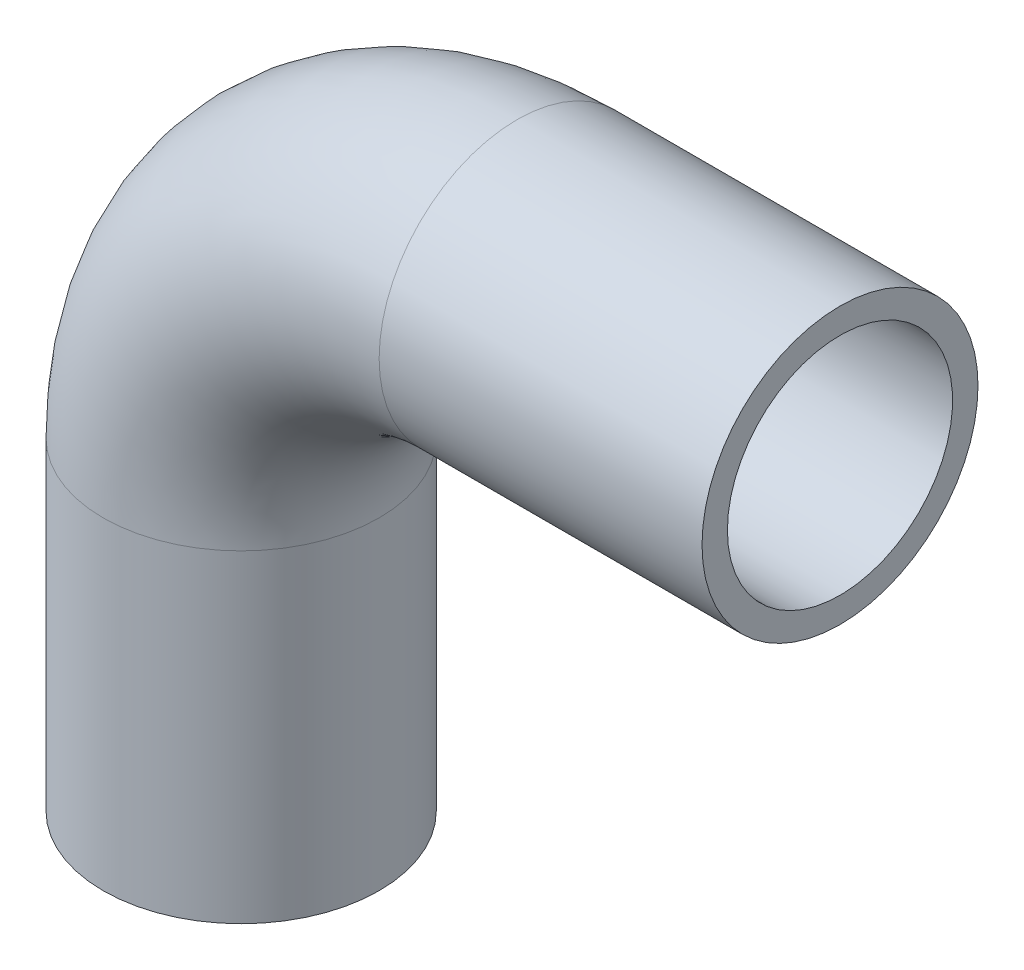
ISO-10303-21;
HEADER;
FILE_DESCRIPTION(('STEP AP214'),'2;1');
FILE_NAME('part.step','',(''),(''),'','','');
FILE_SCHEMA(('AUTOMOTIVE_DESIGN { 1 0 10303 214 1 1 1 1 }'));
ENDSEC;
DATA;
#1=APPLICATION_CONTEXT('core data for automotive mechanical design processes');
#2=APPLICATION_PROTOCOL_DEFINITION('international standard','automotive_design',2000,#1);
#3=PRODUCT_CONTEXT('',#1,'mechanical');
#4=PRODUCT('Part','Part','',(#3));
#5=PRODUCT_RELATED_PRODUCT_CATEGORY('part','',(#4));
#6=PRODUCT_DEFINITION_FORMATION('','',#4);
#7=PRODUCT_DEFINITION_CONTEXT('part definition',#1,'design');
#8=PRODUCT_DEFINITION('design','',#6,#7);
#9=PRODUCT_DEFINITION_SHAPE('','',#8);
#10=(LENGTH_UNIT() NAMED_UNIT(*) SI_UNIT(.MILLI.,.METRE.));
#11=(NAMED_UNIT(*) PLANE_ANGLE_UNIT() SI_UNIT($,.RADIAN.));
#12=(NAMED_UNIT(*) SI_UNIT($,.STERADIAN.) SOLID_ANGLE_UNIT());
#13=UNCERTAINTY_MEASURE_WITH_UNIT(LENGTH_MEASURE(1.E-05),#10,'distance_accuracy_value','');
#14=(GEOMETRIC_REPRESENTATION_CONTEXT(3) GLOBAL_UNCERTAINTY_ASSIGNED_CONTEXT((#13)) GLOBAL_UNIT_ASSIGNED_CONTEXT((#10,
#11,#12)) REPRESENTATION_CONTEXT('',''));
#15=CARTESIAN_POINT('',(0.,0.,0.));
#16=DIRECTION('',(0.,0.,1.));
#17=DIRECTION('',(1.,0.,0.));
#18=AXIS2_PLACEMENT_3D('',#15,#16,#17);
#19=CARTESIAN_POINT('',(50.,58.5,0.));
#20=DIRECTION('',(0.,0.,1.));
#21=DIRECTION('',(1.,0.,0.));
#22=AXIS2_PLACEMENT_3D('',#19,#20,#21);
#23=TOROIDAL_SURFACE('',#22,50.,20.4);
#24=CARTESIAN_POINT('',(50.,108.5,0.));
#25=DIRECTION('',(-1.,0.,0.));
#26=DIRECTION('',(0.,1.,0.));
#27=AXIS2_PLACEMENT_3D('',#24,#25,#26);
#28=CIRCLE('',#27,20.4);
#29=CARTESIAN_POINT('',(50.,128.9,0.));
#30=VERTEX_POINT('',#29);
#31=EDGE_CURVE('E33',#30,#30,#28,.T.);
#32=ORIENTED_EDGE('',*,*,#31,.F.);
#33=EDGE_LOOP('',(#32));
#34=FACE_BOUND('',#33,.T.);
#35=CARTESIAN_POINT('',(0.,58.5,0.));
#36=DIRECTION('',(0.,-1.,0.));
#37=DIRECTION('',(-1.,0.,0.));
#38=AXIS2_PLACEMENT_3D('',#35,#36,#37);
#39=CIRCLE('',#38,20.4);
#40=CARTESIAN_POINT('',(-20.4,58.5,0.));
#41=VERTEX_POINT('',#40);
#42=EDGE_CURVE('E31',#41,#41,#39,.F.);
#43=ORIENTED_EDGE('',*,*,#42,.F.);
#44=EDGE_LOOP('',(#43));
#45=FACE_BOUND('',#44,.T.);
#46=ADVANCED_FACE('F13',(#34,#45),#23,.F.);
#47=CARTESIAN_POINT('',(108.5,108.5,0.));
#48=DIRECTION('',(-1.,0.,0.));
#49=DIRECTION('',(0.,0.,1.));
#50=AXIS2_PLACEMENT_3D('',#47,#48,#49);
#51=CYLINDRICAL_SURFACE('',#50,20.4);
#52=CARTESIAN_POINT('',(108.5,108.5,0.));
#53=DIRECTION('',(-1.,0.,0.));
#54=DIRECTION('',(0.,0.,1.));
#55=AXIS2_PLACEMENT_3D('',#52,#53,#54);
#56=CIRCLE('',#55,20.4);
#57=CARTESIAN_POINT('',(108.5,108.5,20.4));
#58=VERTEX_POINT('',#57);
#59=EDGE_CURVE('E17',#58,#58,#56,.T.);
#60=ORIENTED_EDGE('',*,*,#59,.F.);
#61=EDGE_LOOP('',(#60));
#62=FACE_BOUND('',#61,.T.);
#63=ORIENTED_EDGE('',*,*,#31,.T.);
#64=EDGE_LOOP('',(#63));
#65=FACE_BOUND('',#64,.T.);
#66=ADVANCED_FACE('F52',(#62,#65),#51,.F.);
#67=CARTESIAN_POINT('',(0.,58.5,0.));
#68=DIRECTION('',(0.,-1.,0.));
#69=DIRECTION('',(0.,0.,-1.));
#70=AXIS2_PLACEMENT_3D('',#67,#68,#69);
#71=CYLINDRICAL_SURFACE('',#70,20.4);
#72=ORIENTED_EDGE('',*,*,#42,.T.);
#73=EDGE_LOOP('',(#72));
#74=FACE_BOUND('',#73,.T.);
#75=CARTESIAN_POINT('',(0.,0.,0.));
#76=DIRECTION('',(0.,-1.,0.));
#77=DIRECTION('',(0.,0.,-1.));
#78=AXIS2_PLACEMENT_3D('',#75,#76,#77);
#79=CIRCLE('',#78,20.4);
#80=CARTESIAN_POINT('',(0.,0.,-20.4));
#81=VERTEX_POINT('',#80);
#82=EDGE_CURVE('E42',#81,#81,#79,.F.);
#83=ORIENTED_EDGE('',*,*,#82,.F.);
#84=EDGE_LOOP('',(#83));
#85=FACE_BOUND('',#84,.T.);
#86=ADVANCED_FACE('F55',(#74,#85),#71,.F.);
#87=CARTESIAN_POINT('',(108.5,133.5,25.3000021083535));
#88=DIRECTION('',(1.,0.,0.));
#89=DIRECTION('',(0.,-1.,0.));
#90=AXIS2_PLACEMENT_3D('',#87,#88,#89);
#91=PLANE('',#90);
#92=ORIENTED_EDGE('',*,*,#59,.T.);
#93=EDGE_LOOP('',(#92));
#94=FACE_BOUND('',#93,.T.);
#95=CARTESIAN_POINT('',(108.5,108.5,0.));
#96=DIRECTION('',(-1.,0.,0.));
#97=DIRECTION('',(0.,0.,1.));
#98=AXIS2_PLACEMENT_3D('',#95,#96,#97);
#99=CIRCLE('',#98,25.);
#100=CARTESIAN_POINT('',(108.5,108.5,25.));
#101=VERTEX_POINT('',#100);
#102=EDGE_CURVE('E40',#101,#101,#99,.T.);
#103=ORIENTED_EDGE('',*,*,#102,.F.);
#104=EDGE_LOOP('',(#103));
#105=FACE_BOUND('',#104,.T.);
#106=ADVANCED_FACE('F49',(#94,#105),#91,.T.);
#107=CARTESIAN_POINT('',(25.,0.,25.3000021083545));
#108=DIRECTION('',(0.,-1.,0.));
#109=DIRECTION('',(-1.,0.,0.));
#110=AXIS2_PLACEMENT_3D('',#107,#108,#109);
#111=PLANE('',#110);
#112=ORIENTED_EDGE('',*,*,#82,.T.);
#113=EDGE_LOOP('',(#112));
#114=FACE_BOUND('',#113,.T.);
#115=CARTESIAN_POINT('',(0.,0.,0.));
#116=DIRECTION('',(0.,-1.,0.));
#117=DIRECTION('',(0.,0.,-1.));
#118=AXIS2_PLACEMENT_3D('',#115,#116,#117);
#119=CIRCLE('',#118,25.);
#120=CARTESIAN_POINT('',(0.,0.,-25.));
#121=VERTEX_POINT('',#120);
#122=EDGE_CURVE('E26',#121,#121,#119,.F.);
#123=ORIENTED_EDGE('',*,*,#122,.F.);
#124=EDGE_LOOP('',(#123));
#125=FACE_BOUND('',#124,.T.);
#126=ADVANCED_FACE('F69',(#114,#125),#111,.T.);
#127=CARTESIAN_POINT('',(50.,108.5,0.));
#128=DIRECTION('',(-1.,0.,0.));
#129=DIRECTION('',(0.,0.,1.));
#130=AXIS2_PLACEMENT_3D('',#127,#128,#129);
#131=CYLINDRICAL_SURFACE('',#130,25.);
#132=ORIENTED_EDGE('',*,*,#102,.T.);
#133=EDGE_LOOP('',(#132));
#134=FACE_BOUND('',#133,.T.);
#135=CARTESIAN_POINT('',(50.,108.5,0.));
#136=DIRECTION('',(-1.,0.,0.));
#137=DIRECTION('',(0.,-1.,0.));
#138=AXIS2_PLACEMENT_3D('',#135,#136,#137);
#139=CIRCLE('',#138,25.);
#140=CARTESIAN_POINT('',(50.,83.5,0.));
#141=VERTEX_POINT('',#140);
#142=EDGE_CURVE('E21',#141,#141,#139,.T.);
#143=ORIENTED_EDGE('',*,*,#142,.F.);
#144=EDGE_LOOP('',(#143));
#145=FACE_BOUND('',#144,.T.);
#146=ADVANCED_FACE('F79',(#134,#145),#131,.T.);
#147=CARTESIAN_POINT('',(0.,0.,0.));
#148=DIRECTION('',(0.,-1.,0.));
#149=DIRECTION('',(0.,0.,-1.));
#150=AXIS2_PLACEMENT_3D('',#147,#148,#149);
#151=CYLINDRICAL_SURFACE('',#150,25.);
#152=CARTESIAN_POINT('',(0.,58.5,0.));
#153=DIRECTION('',(0.,-1.,0.));
#154=DIRECTION('',(1.,0.,0.));
#155=AXIS2_PLACEMENT_3D('',#152,#153,#154);
#156=CIRCLE('',#155,25.);
#157=CARTESIAN_POINT('',(25.,58.5,0.));
#158=VERTEX_POINT('',#157);
#159=EDGE_CURVE('E8',#158,#158,#156,.F.);
#160=ORIENTED_EDGE('',*,*,#159,.F.);
#161=EDGE_LOOP('',(#160));
#162=FACE_BOUND('',#161,.T.);
#163=ORIENTED_EDGE('',*,*,#122,.T.);
#164=EDGE_LOOP('',(#163));
#165=FACE_BOUND('',#164,.T.);
#166=ADVANCED_FACE('F73',(#162,#165),#151,.T.);
#167=CARTESIAN_POINT('',(50.,58.5,0.));
#168=DIRECTION('',(0.,0.,1.));
#169=DIRECTION('',(1.,0.,0.));
#170=AXIS2_PLACEMENT_3D('',#167,#168,#169);
#171=TOROIDAL_SURFACE('',#170,50.,25.);
#172=ORIENTED_EDGE('',*,*,#142,.T.);
#173=EDGE_LOOP('',(#172));
#174=FACE_BOUND('',#173,.T.);
#175=ORIENTED_EDGE('',*,*,#159,.T.);
#176=EDGE_LOOP('',(#175));
#177=FACE_BOUND('',#176,.T.);
#178=ADVANCED_FACE('F71',(#174,#177),#171,.T.);
#179=CLOSED_SHELL('',(#46,#66,#86,#106,#126,#146,#166,#178));
#180=MANIFOLD_SOLID_BREP('B1',#179);
#181=ADVANCED_BREP_SHAPE_REPRESENTATION('',(#18,#180),#14);
#182=SHAPE_DEFINITION_REPRESENTATION(#9,#181);
ENDSEC;
END-ISO-10303-21;
